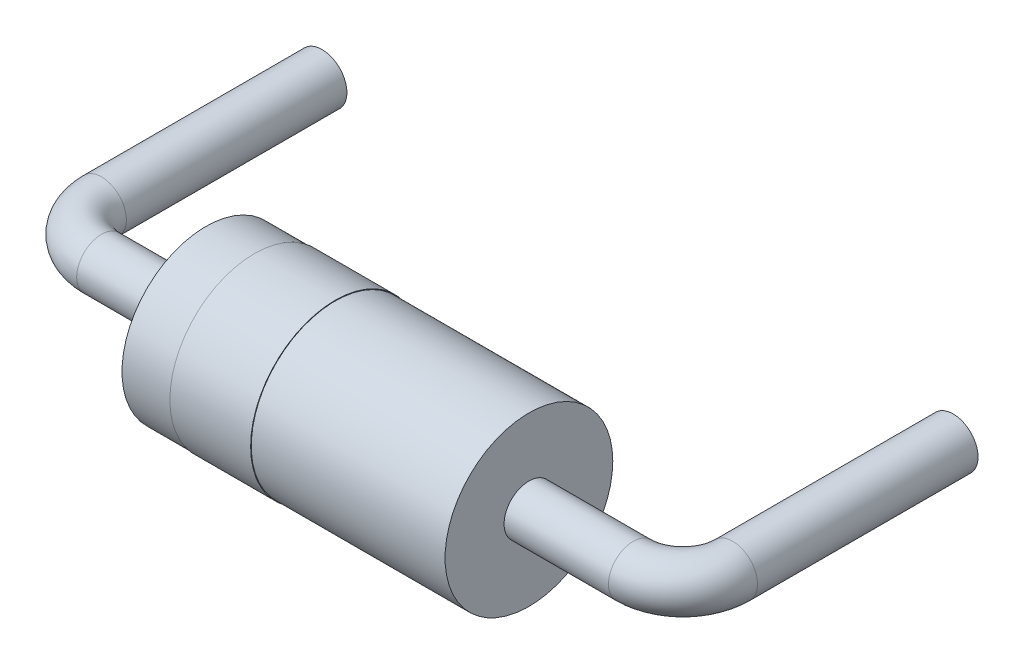
ISO-10303-21;
HEADER;
FILE_DESCRIPTION(('STEP AP214'),'2;1');
FILE_NAME('part.step','',(''),(''),'','','');
FILE_SCHEMA(('AUTOMOTIVE_DESIGN { 1 0 10303 214 1 1 1 1 }'));
ENDSEC;
DATA;
#1=APPLICATION_CONTEXT('core data for automotive mechanical design processes');
#2=APPLICATION_PROTOCOL_DEFINITION('international standard','automotive_design',2000,#1);
#3=PRODUCT_CONTEXT('',#1,'mechanical');
#4=PRODUCT('Part','Part','',(#3));
#5=PRODUCT_RELATED_PRODUCT_CATEGORY('part','',(#4));
#6=PRODUCT_DEFINITION_FORMATION('','',#4);
#7=PRODUCT_DEFINITION_CONTEXT('part definition',#1,'design');
#8=PRODUCT_DEFINITION('design','',#6,#7);
#9=PRODUCT_DEFINITION_SHAPE('','',#8);
#10=(LENGTH_UNIT() NAMED_UNIT(*) SI_UNIT(.MILLI.,.METRE.));
#11=(NAMED_UNIT(*) PLANE_ANGLE_UNIT() SI_UNIT($,.RADIAN.));
#12=(NAMED_UNIT(*) SI_UNIT($,.STERADIAN.) SOLID_ANGLE_UNIT());
#13=UNCERTAINTY_MEASURE_WITH_UNIT(LENGTH_MEASURE(1.E-05),#10,'distance_accuracy_value','');
#14=(GEOMETRIC_REPRESENTATION_CONTEXT(3) GLOBAL_UNCERTAINTY_ASSIGNED_CONTEXT((#13)) GLOBAL_UNIT_ASSIGNED_CONTEXT((#10,
#11,#12)) REPRESENTATION_CONTEXT('',''));
#15=CARTESIAN_POINT('',(0.,0.,0.));
#16=DIRECTION('',(0.,0.,1.));
#17=DIRECTION('',(1.,0.,0.));
#18=AXIS2_PLACEMENT_3D('',#15,#16,#17);
#19=CARTESIAN_POINT('',(0.4,-0.408,-2.5));
#20=DIRECTION('',(0.,0.,-1.));
#21=DIRECTION('',(-1.,0.,0.));
#22=AXIS2_PLACEMENT_3D('',#19,#20,#21);
#23=PLANE('',#22);
#24=CARTESIAN_POINT('',(2.59205634386972E-13,0.,-2.5));
#25=DIRECTION('',(0.,0.,1.));
#26=DIRECTION('',(1.,0.,0.));
#27=AXIS2_PLACEMENT_3D('',#24,#25,#26);
#28=CIRCLE('',#27,0.400000000000043);
#29=CARTESIAN_POINT('',(0.400000000000302,0.,-2.5));
#30=VERTEX_POINT('',#29);
#31=EDGE_CURVE('E19',#30,#30,#28,.T.);
#32=ORIENTED_EDGE('',*,*,#31,.F.);
#33=EDGE_LOOP('',(#32));
#34=FACE_BOUND('',#33,.T.);
#35=ADVANCED_FACE('F15',(#34),#23,.T.);
#36=CARTESIAN_POINT('',(2.59205634386972E-13,0.,-2.5));
#37=DIRECTION('',(0.,0.,1.));
#38=DIRECTION('',(1.,0.,0.));
#39=AXIS2_PLACEMENT_3D('',#36,#37,#38);
#40=CYLINDRICAL_SURFACE('',#39,0.400000000000043);
#41=CARTESIAN_POINT('',(2.5969352536459E-13,0.,1.05));
#42=DIRECTION('',(0.,0.,1.));
#43=DIRECTION('',(1.,0.,0.));
#44=AXIS2_PLACEMENT_3D('',#41,#42,#43);
#45=CIRCLE('',#44,0.400000000000044);
#46=CARTESIAN_POINT('',(-0.399999999999784,0.,1.05));
#47=VERTEX_POINT('',#46);
#48=EDGE_CURVE('E31',#47,#47,#45,.T.);
#49=ORIENTED_EDGE('',*,*,#48,.F.);
#50=EDGE_LOOP('',(#49));
#51=FACE_BOUND('',#50,.T.);
#52=ORIENTED_EDGE('',*,*,#31,.T.);
#53=EDGE_LOOP('',(#52));
#54=FACE_BOUND('',#53,.T.);
#55=ADVANCED_FACE('F190',(#51,#54),#40,.T.);
#56=CARTESIAN_POINT('',(0.8,0.,1.05));
#57=DIRECTION('',(0.,1.,0.));
#58=DIRECTION('',(0.,0.,1.));
#59=AXIS2_PLACEMENT_3D('',#56,#57,#58);
#60=TOROIDAL_SURFACE('',#59,0.79999999999974,0.400000000000044);
#61=CARTESIAN_POINT('',(0.8,0.,1.84999999999974));
#62=DIRECTION('',(1.,0.,0.));
#63=DIRECTION('',(0.,0.,-1.));
#64=AXIS2_PLACEMENT_3D('',#61,#62,#63);
#65=CIRCLE('',#64,0.400000000000043);
#66=CARTESIAN_POINT('',(0.8,0.,2.24999999999978));
#67=VERTEX_POINT('',#66);
#68=EDGE_CURVE('E54',#67,#67,#65,.T.);
#69=CARTESIAN_POINT('',(0.8,0.,1.05));
#70=DIRECTION('',(0.,1.,0.));
#71=DIRECTION('',(0.,0.,1.));
#72=AXIS2_PLACEMENT_3D('',#69,#70,#71);
#73=CIRCLE('',#72,1.19999999999978);
#74=EDGE_CURVE('',#47,#67,#73,.T.);
#75=ORIENTED_EDGE('',*,*,#48,.T.);
#76=ORIENTED_EDGE('',*,*,#68,.F.);
#77=ORIENTED_EDGE('',*,*,#74,.T.);
#78=ORIENTED_EDGE('',*,*,#74,.F.);
#79=EDGE_LOOP('',(#75,#77,#76,#78));
#80=FACE_BOUND('',#79,.T.);
#81=ADVANCED_FACE('F181',(#80),#60,.T.);
#82=CARTESIAN_POINT('',(0.8,0.,1.84999999999974));
#83=DIRECTION('',(1.,0.,0.));
#84=DIRECTION('',(0.,0.,-1.));
#85=AXIS2_PLACEMENT_3D('',#82,#83,#84);
#86=CYLINDRICAL_SURFACE('',#85,0.400000000000043);
#87=CARTESIAN_POINT('',(2.48,0.,1.84999999999974));
#88=DIRECTION('',(1.,0.,0.));
#89=DIRECTION('',(0.,0.,-1.));
#90=AXIS2_PLACEMENT_3D('',#87,#88,#89);
#91=CIRCLE('',#90,0.400000000000043);
#92=CARTESIAN_POINT('',(2.48,0.,1.4499999999997));
#93=VERTEX_POINT('',#92);
#94=EDGE_CURVE('E52',#93,#93,#91,.F.);
#95=ORIENTED_EDGE('',*,*,#94,.T.);
#96=EDGE_LOOP('',(#95));
#97=FACE_BOUND('',#96,.T.);
#98=ORIENTED_EDGE('',*,*,#68,.T.);
#99=EDGE_LOOP('',(#98));
#100=FACE_BOUND('',#99,.T.);
#101=ADVANCED_FACE('F172',(#97,#100),#86,.T.);
#102=CARTESIAN_POINT('',(2.48,1.377,0.473));
#103=DIRECTION('',(1.,0.,0.));
#104=DIRECTION('',(0.,0.,1.));
#105=AXIS2_PLACEMENT_3D('',#102,#103,#104);
#106=PLANE('',#105);
#107=ORIENTED_EDGE('',*,*,#94,.F.);
#108=EDGE_LOOP('',(#107));
#109=FACE_BOUND('',#108,.T.);
#110=CARTESIAN_POINT('',(2.48,0.,1.85000000000001));
#111=DIRECTION('',(1.,0.,0.));
#112=DIRECTION('',(0.,0.,-1.));
#113=AXIS2_PLACEMENT_3D('',#110,#111,#112);
#114=CIRCLE('',#113,1.35);
#115=CARTESIAN_POINT('',(2.48,0.,0.500000000000008));
#116=VERTEX_POINT('',#115);
#117=EDGE_CURVE('E50',#116,#116,#114,.T.);
#118=ORIENTED_EDGE('',*,*,#117,.F.);
#119=EDGE_LOOP('',(#118));
#120=FACE_BOUND('',#119,.T.);
#121=ADVANCED_FACE('F162',(#109,#120),#106,.F.);
#122=CARTESIAN_POINT('',(9.76,-0.408,-2.5));
#123=DIRECTION('',(0.,0.,1.));
#124=DIRECTION('',(1.,0.,0.));
#125=AXIS2_PLACEMENT_3D('',#122,#123,#124);
#126=PLANE('',#125);
#127=CARTESIAN_POINT('',(10.1599999999997,0.,-2.5));
#128=DIRECTION('',(0.,0.,-1.));
#129=DIRECTION('',(-1.,0.,0.));
#130=AXIS2_PLACEMENT_3D('',#127,#128,#129);
#131=CIRCLE('',#130,0.400000000000043);
#132=CARTESIAN_POINT('',(9.7599999999997,0.,-2.5));
#133=VERTEX_POINT('',#132);
#134=EDGE_CURVE('E47',#133,#133,#131,.F.);
#135=ORIENTED_EDGE('',*,*,#134,.F.);
#136=EDGE_LOOP('',(#135));
#137=FACE_BOUND('',#136,.T.);
#138=ADVANCED_FACE('F151',(#137),#126,.F.);
#139=CARTESIAN_POINT('',(2.48,0.,1.85000000000001));
#140=DIRECTION('',(1.,0.,0.));
#141=DIRECTION('',(0.,0.,-1.));
#142=AXIS2_PLACEMENT_3D('',#139,#140,#141);
#143=CYLINDRICAL_SURFACE('',#142,1.35);
#144=ORIENTED_EDGE('',*,*,#117,.T.);
#145=EDGE_LOOP('',(#144));
#146=FACE_BOUND('',#145,.T.);
#147=CARTESIAN_POINT('',(3.26,0.,1.85000000000001));
#148=DIRECTION('',(1.,0.,0.));
#149=DIRECTION('',(0.,0.,-1.));
#150=AXIS2_PLACEMENT_3D('',#147,#148,#149);
#151=CIRCLE('',#150,1.35);
#152=CARTESIAN_POINT('',(3.26,0.,0.500000000000008));
#153=VERTEX_POINT('',#152);
#154=EDGE_CURVE('E44',#153,#153,#151,.F.);
#155=ORIENTED_EDGE('',*,*,#154,.T.);
#156=EDGE_LOOP('',(#155));
#157=FACE_BOUND('',#156,.T.);
#158=ADVANCED_FACE('F140',(#146,#157),#143,.T.);
#159=CARTESIAN_POINT('',(10.1599999999997,0.,1.05));
#160=DIRECTION('',(0.,0.,-1.));
#161=DIRECTION('',(-1.,0.,0.));
#162=AXIS2_PLACEMENT_3D('',#159,#160,#161);
#163=CYLINDRICAL_SURFACE('',#162,0.400000000000043);
#164=ORIENTED_EDGE('',*,*,#134,.T.);
#165=EDGE_LOOP('',(#164));
#166=FACE_BOUND('',#165,.T.);
#167=CARTESIAN_POINT('',(10.1599999999997,0.,1.05));
#168=DIRECTION('',(0.,0.,1.));
#169=DIRECTION('',(1.,0.,0.));
#170=AXIS2_PLACEMENT_3D('',#167,#168,#169);
#171=CIRCLE('',#170,0.400000000000043);
#172=CARTESIAN_POINT('',(10.5599999999998,0.,1.05));
#173=VERTEX_POINT('',#172);
#174=EDGE_CURVE('E43',#173,#173,#171,.T.);
#175=ORIENTED_EDGE('',*,*,#174,.F.);
#176=EDGE_LOOP('',(#175));
#177=FACE_BOUND('',#176,.T.);
#178=ADVANCED_FACE('F83',(#166,#177),#163,.T.);
#179=CARTESIAN_POINT('',(3.26,1.3872,0.4628));
#180=DIRECTION('',(1.,0.,0.));
#181=DIRECTION('',(0.,0.,1.));
#182=AXIS2_PLACEMENT_3D('',#179,#180,#181);
#183=PLANE('',#182);
#184=ORIENTED_EDGE('',*,*,#154,.F.);
#185=EDGE_LOOP('',(#184));
#186=FACE_BOUND('',#185,.T.);
#187=CARTESIAN_POINT('',(3.26,0.,1.85000000000019));
#188=DIRECTION('',(1.,0.,0.));
#189=DIRECTION('',(0.,0.,-1.));
#190=AXIS2_PLACEMENT_3D('',#187,#188,#189);
#191=CIRCLE('',#190,1.36000000000003);
#192=CARTESIAN_POINT('',(3.26,0.,0.490000000000157));
#193=VERTEX_POINT('',#192);
#194=EDGE_CURVE('E40',#193,#193,#191,.T.);
#195=ORIENTED_EDGE('',*,*,#194,.F.);
#196=EDGE_LOOP('',(#195));
#197=FACE_BOUND('',#196,.T.);
#198=ADVANCED_FACE('F73',(#186,#197),#183,.F.);
#199=CARTESIAN_POINT('',(9.36,0.,1.05));
#200=DIRECTION('',(0.,1.,0.));
#201=DIRECTION('',(0.,0.,1.));
#202=AXIS2_PLACEMENT_3D('',#199,#200,#201);
#203=TOROIDAL_SURFACE('',#202,0.79999999999974,0.400000000000043);
#204=CARTESIAN_POINT('',(9.36,0.,1.84999999999974));
#205=DIRECTION('',(-1.,0.,0.));
#206=DIRECTION('',(0.,0.,1.));
#207=AXIS2_PLACEMENT_3D('',#204,#205,#206);
#208=CIRCLE('',#207,0.400000000000043);
#209=CARTESIAN_POINT('',(9.36,0.,2.24999999999978));
#210=VERTEX_POINT('',#209);
#211=EDGE_CURVE('E39',#210,#210,#208,.T.);
#212=CARTESIAN_POINT('',(9.36,0.,1.05));
#213=DIRECTION('',(0.,1.,0.));
#214=DIRECTION('',(0.,0.,1.));
#215=AXIS2_PLACEMENT_3D('',#212,#213,#214);
#216=CIRCLE('',#215,1.19999999999978);
#217=EDGE_CURVE('',#210,#173,#216,.T.);
#218=ORIENTED_EDGE('',*,*,#211,.F.);
#219=ORIENTED_EDGE('',*,*,#174,.T.);
#220=ORIENTED_EDGE('',*,*,#217,.T.);
#221=ORIENTED_EDGE('',*,*,#217,.F.);
#222=EDGE_LOOP('',(#218,#220,#219,#221));
#223=FACE_BOUND('',#222,.T.);
#224=ADVANCED_FACE('F70',(#223),#203,.T.);
#225=CARTESIAN_POINT('',(3.26,0.,1.85000000000019));
#226=DIRECTION('',(1.,0.,0.));
#227=DIRECTION('',(0.,0.,-1.));
#228=AXIS2_PLACEMENT_3D('',#225,#226,#227);
#229=CYLINDRICAL_SURFACE('',#228,1.36000000000003);
#230=CARTESIAN_POINT('',(4.56,0.,1.85000000000019));
#231=DIRECTION('',(1.,0.,0.));
#232=DIRECTION('',(0.,0.,-1.));
#233=AXIS2_PLACEMENT_3D('',#230,#231,#232);
#234=CIRCLE('',#233,1.36000000000003);
#235=CARTESIAN_POINT('',(4.56,0.,0.490000000000157));
#236=VERTEX_POINT('',#235);
#237=EDGE_CURVE('E36',#236,#236,#234,.T.);
#238=ORIENTED_EDGE('',*,*,#237,.F.);
#239=EDGE_LOOP('',(#238));
#240=FACE_BOUND('',#239,.T.);
#241=ORIENTED_EDGE('',*,*,#194,.T.);
#242=EDGE_LOOP('',(#241));
#243=FACE_BOUND('',#242,.T.);
#244=ADVANCED_FACE('F72',(#240,#243),#229,.T.);
#245=CARTESIAN_POINT('',(7.68,0.,1.84999999999974));
#246=DIRECTION('',(1.,0.,0.));
#247=DIRECTION('',(0.,0.,-1.));
#248=AXIS2_PLACEMENT_3D('',#245,#246,#247);
#249=CYLINDRICAL_SURFACE('',#248,0.400000000000043);
#250=ORIENTED_EDGE('',*,*,#211,.T.);
#251=EDGE_LOOP('',(#250));
#252=FACE_BOUND('',#251,.T.);
#253=CARTESIAN_POINT('',(7.68,0.,1.84999999999974));
#254=DIRECTION('',(1.,0.,0.));
#255=DIRECTION('',(0.,0.,-1.));
#256=AXIS2_PLACEMENT_3D('',#253,#254,#255);
#257=CIRCLE('',#256,0.400000000000043);
#258=CARTESIAN_POINT('',(7.68,0.,1.4499999999997));
#259=VERTEX_POINT('',#258);
#260=EDGE_CURVE('E28',#259,#259,#257,.F.);
#261=ORIENTED_EDGE('',*,*,#260,.F.);
#262=EDGE_LOOP('',(#261));
#263=FACE_BOUND('',#262,.T.);
#264=ADVANCED_FACE('F67',(#252,#263),#249,.T.);
#265=CARTESIAN_POINT('',(4.56,1.3872,0.4628));
#266=DIRECTION('',(1.,0.,0.));
#267=DIRECTION('',(0.,0.,1.));
#268=AXIS2_PLACEMENT_3D('',#265,#266,#267);
#269=PLANE('',#268);
#270=CARTESIAN_POINT('',(4.56,0.,1.85000000000001));
#271=DIRECTION('',(1.,0.,0.));
#272=DIRECTION('',(0.,0.,-1.));
#273=AXIS2_PLACEMENT_3D('',#270,#271,#272);
#274=CIRCLE('',#273,1.35);
#275=CARTESIAN_POINT('',(4.56,0.,0.500000000000008));
#276=VERTEX_POINT('',#275);
#277=EDGE_CURVE('E23',#276,#276,#274,.T.);
#278=ORIENTED_EDGE('',*,*,#277,.F.);
#279=EDGE_LOOP('',(#278));
#280=FACE_BOUND('',#279,.T.);
#281=ORIENTED_EDGE('',*,*,#237,.T.);
#282=EDGE_LOOP('',(#281));
#283=FACE_BOUND('',#282,.T.);
#284=ADVANCED_FACE('F91',(#280,#283),#269,.T.);
#285=CARTESIAN_POINT('',(7.68,1.377,0.473));
#286=DIRECTION('',(1.,0.,0.));
#287=DIRECTION('',(0.,0.,1.));
#288=AXIS2_PLACEMENT_3D('',#285,#286,#287);
#289=PLANE('',#288);
#290=ORIENTED_EDGE('',*,*,#260,.T.);
#291=EDGE_LOOP('',(#290));
#292=FACE_BOUND('',#291,.T.);
#293=CARTESIAN_POINT('',(7.68,0.,1.85000000000001));
#294=DIRECTION('',(1.,0.,0.));
#295=DIRECTION('',(0.,0.,-1.));
#296=AXIS2_PLACEMENT_3D('',#293,#294,#295);
#297=CIRCLE('',#296,1.35);
#298=CARTESIAN_POINT('',(7.68,0.,0.500000000000008));
#299=VERTEX_POINT('',#298);
#300=EDGE_CURVE('E10',#299,#299,#297,.F.);
#301=ORIENTED_EDGE('',*,*,#300,.F.);
#302=EDGE_LOOP('',(#301));
#303=FACE_BOUND('',#302,.T.);
#304=ADVANCED_FACE('F87',(#292,#303),#289,.T.);
#305=CARTESIAN_POINT('',(4.56,0.,1.85000000000001));
#306=DIRECTION('',(1.,0.,0.));
#307=DIRECTION('',(0.,0.,-1.));
#308=AXIS2_PLACEMENT_3D('',#305,#306,#307);
#309=CYLINDRICAL_SURFACE('',#308,1.35);
#310=ORIENTED_EDGE('',*,*,#300,.T.);
#311=EDGE_LOOP('',(#310));
#312=FACE_BOUND('',#311,.T.);
#313=ORIENTED_EDGE('',*,*,#277,.T.);
#314=EDGE_LOOP('',(#313));
#315=FACE_BOUND('',#314,.T.);
#316=ADVANCED_FACE('F17',(#312,#315),#309,.T.);
#317=CLOSED_SHELL('',(#35,#55,#81,#101,#121,#138,#158,#178,#198,#224,#244,#264,#284,#304,#316));
#318=MANIFOLD_SOLID_BREP('B1',#317);
#319=ADVANCED_BREP_SHAPE_REPRESENTATION('',(#18,#318),#14);
#320=SHAPE_DEFINITION_REPRESENTATION(#9,#319);
ENDSEC;
END-ISO-10303-21;
